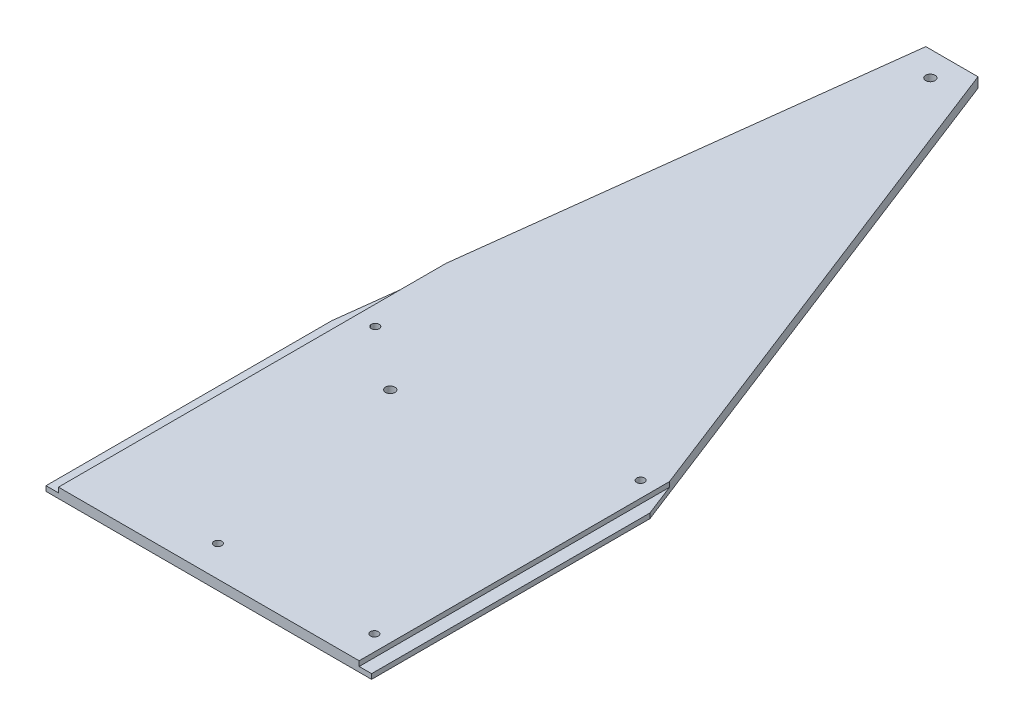
ISO-10303-21;
HEADER;
FILE_DESCRIPTION(('STEP AP214'),'2;1');
FILE_NAME('part.step','',(''),(''),'','','');
FILE_SCHEMA(('AUTOMOTIVE_DESIGN { 1 0 10303 214 1 1 1 1 }'));
ENDSEC;
DATA;
#1=APPLICATION_CONTEXT('core data for automotive mechanical design processes');
#2=APPLICATION_PROTOCOL_DEFINITION('international standard','automotive_design',2000,#1);
#3=PRODUCT_CONTEXT('',#1,'mechanical');
#4=PRODUCT('Part','Part','',(#3));
#5=PRODUCT_RELATED_PRODUCT_CATEGORY('part','',(#4));
#6=PRODUCT_DEFINITION_FORMATION('','',#4);
#7=PRODUCT_DEFINITION_CONTEXT('part definition',#1,'design');
#8=PRODUCT_DEFINITION('design','',#6,#7);
#9=PRODUCT_DEFINITION_SHAPE('','',#8);
#10=(LENGTH_UNIT() NAMED_UNIT(*) SI_UNIT(.MILLI.,.METRE.));
#11=(NAMED_UNIT(*) PLANE_ANGLE_UNIT() SI_UNIT($,.RADIAN.));
#12=(NAMED_UNIT(*) SI_UNIT($,.STERADIAN.) SOLID_ANGLE_UNIT());
#13=UNCERTAINTY_MEASURE_WITH_UNIT(LENGTH_MEASURE(1.E-05),#10,'distance_accuracy_value','');
#14=(GEOMETRIC_REPRESENTATION_CONTEXT(3) GLOBAL_UNCERTAINTY_ASSIGNED_CONTEXT((#13)) GLOBAL_UNIT_ASSIGNED_CONTEXT((#10,
#11,#12)) REPRESENTATION_CONTEXT('',''));
#15=CARTESIAN_POINT('',(0.,0.,0.));
#16=DIRECTION('',(0.,0.,1.));
#17=DIRECTION('',(1.,0.,0.));
#18=AXIS2_PLACEMENT_3D('',#15,#16,#17);
#19=CARTESIAN_POINT('',(0.,6.35,0.));
#20=DIRECTION('',(0.,-1.,0.));
#21=DIRECTION('',(0.,0.,-1.));
#22=AXIS2_PLACEMENT_3D('',#19,#20,#21);
#23=PLANE('',#22);
#24=DIRECTION('',(-0.121166373397696,0.,0.99263221283497));
#25=VECTOR('',#24,1.);
#26=CARTESIAN_POINT('',(0.,6.35,-182.5625));
#27=LINE('',#26,#25);
#28=CARTESIAN_POINT('',(41.2749999999999,6.35,-520.7));
#29=VERTEX_POINT('',#28);
#30=CARTESIAN_POINT('',(7.9375,6.35,-247.588942307692));
#31=VERTEX_POINT('',#30);
#32=EDGE_CURVE('E221',#29,#31,#27,.T.);
#33=ORIENTED_EDGE('',*,*,#32,.T.);
#34=DIRECTION('',(0.,0.,1.));
#35=VECTOR('',#34,1.);
#36=CARTESIAN_POINT('',(7.9375,6.35,-520.7));
#37=LINE('',#36,#35);
#38=CARTESIAN_POINT('',(7.9375,6.35,0.));
#39=VERTEX_POINT('',#38);
#40=EDGE_CURVE('E123',#31,#39,#37,.T.);
#41=ORIENTED_EDGE('',*,*,#40,.T.);
#42=DIRECTION('',(1.,0.,0.));
#43=VECTOR('',#42,1.);
#44=CARTESIAN_POINT('',(207.9625,6.35,0.));
#45=LINE('',#44,#43);
#46=CARTESIAN_POINT('',(200.025,6.35,0.));
#47=VERTEX_POINT('',#46);
#48=EDGE_CURVE('E210',#39,#47,#45,.T.);
#49=ORIENTED_EDGE('',*,*,#48,.T.);
#50=DIRECTION('',(0.,0.,1.));
#51=VECTOR('',#50,1.);
#52=CARTESIAN_POINT('',(200.025,6.35,-520.7));
#53=LINE('',#52,#51);
#54=CARTESIAN_POINT('',(200.025,6.35,-198.210714285714));
#55=VERTEX_POINT('',#54);
#56=EDGE_CURVE('E148',#55,#47,#53,.T.);
#57=ORIENTED_EDGE('',*,*,#56,.F.);
#58=DIRECTION('',(-0.362446261154949,0.,-0.932004671541296));
#59=VECTOR('',#58,1.);
#60=CARTESIAN_POINT('',(74.6124999999999,6.35,-520.7));
#61=LINE('',#60,#59);
#62=CARTESIAN_POINT('',(74.6124999999999,6.35,-520.7));
#63=VERTEX_POINT('',#62);
#64=EDGE_CURVE('E214',#55,#63,#61,.T.);
#65=ORIENTED_EDGE('',*,*,#64,.T.);
#66=DIRECTION('',(-1.,0.,0.));
#67=VECTOR('',#66,1.);
#68=CARTESIAN_POINT('',(41.2749999999999,6.35,-520.7));
#69=LINE('',#68,#67);
#70=EDGE_CURVE('E218',#63,#29,#69,.T.);
#71=ORIENTED_EDGE('',*,*,#70,.T.);
#72=EDGE_LOOP('',(#33,#41,#49,#57,#65,#71));
#73=FACE_BOUND('',#72,.T.);
#74=CARTESIAN_POINT('',(60.0616588419404,6.35,-504.825));
#75=DIRECTION('',(0.,1.,0.));
#76=DIRECTION('',(0.,0.,1.));
#77=AXIS2_PLACEMENT_3D('',#74,#75,#76);
#78=CIRCLE('',#77,3.00000000000001);
#79=CARTESIAN_POINT('',(60.0616588419404,6.35,-501.825));
#80=VERTEX_POINT('',#79);
#81=EDGE_CURVE('E202',#80,#80,#78,.T.);
#82=ORIENTED_EDGE('',*,*,#81,.F.);
#83=EDGE_LOOP('',(#82));
#84=FACE_BOUND('',#83,.T.);
#85=CARTESIAN_POINT('',(20.3016588419406,6.35,-190.035));
#86=DIRECTION('',(0.,1.,0.));
#87=DIRECTION('',(0.,0.,1.));
#88=AXIS2_PLACEMENT_3D('',#85,#86,#87);
#89=CIRCLE('',#88,2.5);
#90=CARTESIAN_POINT('',(20.3016588419406,6.35,-187.535));
#91=VERTEX_POINT('',#90);
#92=EDGE_CURVE('E194',#91,#91,#89,.T.);
#93=ORIENTED_EDGE('',*,*,#92,.F.);
#94=EDGE_LOOP('',(#93));
#95=FACE_BOUND('',#94,.T.);
#96=CARTESIAN_POINT('',(190.081658841941,6.35,-189.735));
#97=DIRECTION('',(0.,1.,0.));
#98=DIRECTION('',(0.,0.,1.));
#99=AXIS2_PLACEMENT_3D('',#96,#97,#98);
#100=CIRCLE('',#99,2.5);
#101=CARTESIAN_POINT('',(190.081658841941,6.35,-187.235));
#102=VERTEX_POINT('',#101);
#103=EDGE_CURVE('E186',#102,#102,#100,.T.);
#104=ORIENTED_EDGE('',*,*,#103,.F.);
#105=EDGE_LOOP('',(#104));
#106=FACE_BOUND('',#105,.T.);
#107=CARTESIAN_POINT('',(190.001658841941,6.35,-19.755));
#108=DIRECTION('',(0.,1.,0.));
#109=DIRECTION('',(0.,0.,1.));
#110=AXIS2_PLACEMENT_3D('',#107,#108,#109);
#111=CIRCLE('',#110,2.5);
#112=CARTESIAN_POINT('',(190.001658841941,6.35,-17.255));
#113=VERTEX_POINT('',#112);
#114=EDGE_CURVE('E178',#113,#113,#111,.T.);
#115=ORIENTED_EDGE('',*,*,#114,.F.);
#116=EDGE_LOOP('',(#115));
#117=FACE_BOUND('',#116,.T.);
#118=CARTESIAN_POINT('',(90.0316588419406,6.35,-19.755));
#119=DIRECTION('',(0.,1.,0.));
#120=DIRECTION('',(0.,0.,1.));
#121=AXIS2_PLACEMENT_3D('',#118,#119,#120);
#122=CIRCLE('',#121,2.5);
#123=CARTESIAN_POINT('',(90.0316588419406,6.35,-17.255));
#124=VERTEX_POINT('',#123);
#125=EDGE_CURVE('E170',#124,#124,#122,.T.);
#126=ORIENTED_EDGE('',*,*,#125,.F.);
#127=EDGE_LOOP('',(#126));
#128=FACE_BOUND('',#127,.T.);
#129=CARTESIAN_POINT('',(60.0616588419405,6.35,-159.795000000001));
#130=DIRECTION('',(0.,1.,0.));
#131=DIRECTION('',(0.,0.,1.));
#132=AXIS2_PLACEMENT_3D('',#129,#130,#131);
#133=CIRCLE('',#132,3.00000000000001);
#134=CARTESIAN_POINT('',(60.0616588419405,6.35,-156.795000000001));
#135=VERTEX_POINT('',#134);
#136=EDGE_CURVE('E162',#135,#135,#133,.T.);
#137=ORIENTED_EDGE('',*,*,#136,.F.);
#138=EDGE_LOOP('',(#137));
#139=FACE_BOUND('',#138,.T.);
#140=ADVANCED_FACE('F39',(#73,#84,#95,#106,#117,#128,#139),#23,.F.);
#141=CARTESIAN_POINT('',(0.,0.,0.));
#142=DIRECTION('',(0.,-1.,0.));
#143=DIRECTION('',(0.,0.,-1.));
#144=AXIS2_PLACEMENT_3D('',#141,#142,#143);
#145=PLANE('',#144);
#146=CARTESIAN_POINT('',(90.0316588419406,0.,-19.755));
#147=DIRECTION('',(0.,1.,0.));
#148=DIRECTION('',(0.,0.,1.));
#149=AXIS2_PLACEMENT_3D('',#146,#147,#148);
#150=CIRCLE('',#149,2.5);
#151=CARTESIAN_POINT('',(90.0316588419406,0.,-17.255));
#152=VERTEX_POINT('',#151);
#153=EDGE_CURVE('E166',#152,#152,#150,.T.);
#154=ORIENTED_EDGE('',*,*,#153,.T.);
#155=EDGE_LOOP('',(#154));
#156=FACE_BOUND('',#155,.T.);
#157=CARTESIAN_POINT('',(190.081658841941,0.,-189.735));
#158=DIRECTION('',(0.,1.,0.));
#159=DIRECTION('',(0.,0.,1.));
#160=AXIS2_PLACEMENT_3D('',#157,#158,#159);
#161=CIRCLE('',#160,2.5);
#162=CARTESIAN_POINT('',(190.081658841941,0.,-187.235));
#163=VERTEX_POINT('',#162);
#164=EDGE_CURVE('E182',#163,#163,#161,.T.);
#165=ORIENTED_EDGE('',*,*,#164,.T.);
#166=EDGE_LOOP('',(#165));
#167=FACE_BOUND('',#166,.T.);
#168=CARTESIAN_POINT('',(60.0616588419404,0.,-504.825));
#169=DIRECTION('',(0.,1.,0.));
#170=DIRECTION('',(0.,0.,1.));
#171=AXIS2_PLACEMENT_3D('',#168,#169,#170);
#172=CIRCLE('',#171,3.00000000000001);
#173=CARTESIAN_POINT('',(60.0616588419404,0.,-501.825));
#174=VERTEX_POINT('',#173);
#175=EDGE_CURVE('E198',#174,#174,#172,.T.);
#176=ORIENTED_EDGE('',*,*,#175,.T.);
#177=EDGE_LOOP('',(#176));
#178=FACE_BOUND('',#177,.T.);
#179=DIRECTION('',(1.,0.,0.));
#180=VECTOR('',#179,1.);
#181=CARTESIAN_POINT('',(207.9625,0.,0.));
#182=LINE('',#181,#180);
#183=CARTESIAN_POINT('',(0.,0.,0.));
#184=VERTEX_POINT('',#183);
#185=CARTESIAN_POINT('',(207.9625,0.,0.));
#186=VERTEX_POINT('',#185);
#187=EDGE_CURVE('E206',#184,#186,#182,.T.);
#188=ORIENTED_EDGE('',*,*,#187,.F.);
#189=DIRECTION('',(0.,0.,1.));
#190=VECTOR('',#189,1.);
#191=CARTESIAN_POINT('',(0.,0.,0.));
#192=LINE('',#191,#190);
#193=CARTESIAN_POINT('',(0.,0.,-182.5625));
#194=VERTEX_POINT('',#193);
#195=EDGE_CURVE('E215',#194,#184,#192,.T.);
#196=ORIENTED_EDGE('',*,*,#195,.F.);
#197=DIRECTION('',(-0.121166373397696,0.,0.99263221283497));
#198=VECTOR('',#197,1.);
#199=CARTESIAN_POINT('',(0.,0.,-182.5625));
#200=LINE('',#199,#198);
#201=CARTESIAN_POINT('',(41.2749999999999,0.,-520.7));
#202=VERTEX_POINT('',#201);
#203=EDGE_CURVE('E238',#202,#194,#200,.T.);
#204=ORIENTED_EDGE('',*,*,#203,.F.);
#205=DIRECTION('',(-1.,0.,0.));
#206=VECTOR('',#205,1.);
#207=CARTESIAN_POINT('',(41.2749999999999,0.,-520.7));
#208=LINE('',#207,#206);
#209=CARTESIAN_POINT('',(74.6124999999999,0.,-520.7));
#210=VERTEX_POINT('',#209);
#211=EDGE_CURVE('E235',#210,#202,#208,.T.);
#212=ORIENTED_EDGE('',*,*,#211,.F.);
#213=DIRECTION('',(-0.362446261154949,0.,-0.932004671541296));
#214=VECTOR('',#213,1.);
#215=CARTESIAN_POINT('',(74.6124999999999,0.,-520.7));
#216=LINE('',#215,#214);
#217=CARTESIAN_POINT('',(207.9625,0.,-177.8));
#218=VERTEX_POINT('',#217);
#219=EDGE_CURVE('E232',#218,#210,#216,.T.);
#220=ORIENTED_EDGE('',*,*,#219,.F.);
#221=DIRECTION('',(0.,0.,-1.));
#222=VECTOR('',#221,1.);
#223=CARTESIAN_POINT('',(207.9625,0.,-177.8));
#224=LINE('',#223,#222);
#225=EDGE_CURVE('E228',#186,#218,#224,.T.);
#226=ORIENTED_EDGE('',*,*,#225,.F.);
#227=EDGE_LOOP('',(#188,#196,#204,#212,#220,#226));
#228=FACE_BOUND('',#227,.T.);
#229=CARTESIAN_POINT('',(20.3016588419406,0.,-190.035));
#230=DIRECTION('',(0.,1.,0.));
#231=DIRECTION('',(0.,0.,1.));
#232=AXIS2_PLACEMENT_3D('',#229,#230,#231);
#233=CIRCLE('',#232,2.5);
#234=CARTESIAN_POINT('',(20.3016588419406,0.,-187.535));
#235=VERTEX_POINT('',#234);
#236=EDGE_CURVE('E190',#235,#235,#233,.T.);
#237=ORIENTED_EDGE('',*,*,#236,.T.);
#238=EDGE_LOOP('',(#237));
#239=FACE_BOUND('',#238,.T.);
#240=CARTESIAN_POINT('',(190.001658841941,0.,-19.755));
#241=DIRECTION('',(0.,1.,0.));
#242=DIRECTION('',(0.,0.,1.));
#243=AXIS2_PLACEMENT_3D('',#240,#241,#242);
#244=CIRCLE('',#243,2.5);
#245=CARTESIAN_POINT('',(190.001658841941,0.,-17.255));
#246=VERTEX_POINT('',#245);
#247=EDGE_CURVE('E174',#246,#246,#244,.T.);
#248=ORIENTED_EDGE('',*,*,#247,.T.);
#249=EDGE_LOOP('',(#248));
#250=FACE_BOUND('',#249,.T.);
#251=CARTESIAN_POINT('',(60.0616588419405,0.,-159.795000000001));
#252=DIRECTION('',(0.,1.,0.));
#253=DIRECTION('',(0.,0.,1.));
#254=AXIS2_PLACEMENT_3D('',#251,#252,#253);
#255=CIRCLE('',#254,3.00000000000001);
#256=CARTESIAN_POINT('',(60.0616588419405,0.,-156.795000000001));
#257=VERTEX_POINT('',#256);
#258=EDGE_CURVE('E161',#257,#257,#255,.T.);
#259=ORIENTED_EDGE('',*,*,#258,.T.);
#260=EDGE_LOOP('',(#259));
#261=FACE_BOUND('',#260,.T.);
#262=ADVANCED_FACE('F290',(#156,#167,#178,#228,#239,#250,#261),#145,.T.);
#263=CARTESIAN_POINT('',(207.9625,6.35,0.));
#264=DIRECTION('',(0.,0.,-1.));
#265=DIRECTION('',(-1.,0.,0.));
#266=AXIS2_PLACEMENT_3D('',#263,#264,#265);
#267=PLANE('',#266);
#268=ORIENTED_EDGE('',*,*,#48,.F.);
#269=DIRECTION('',(0.,-1.,0.));
#270=VECTOR('',#269,1.);
#271=CARTESIAN_POINT('',(7.93749999999999,6.35,0.));
#272=LINE('',#271,#270);
#273=CARTESIAN_POINT('',(7.9375,3.175,0.));
#274=VERTEX_POINT('',#273);
#275=EDGE_CURVE('E144',#39,#274,#272,.T.);
#276=ORIENTED_EDGE('',*,*,#275,.T.);
#277=DIRECTION('',(-1.,0.,0.));
#278=VECTOR('',#277,1.);
#279=CARTESIAN_POINT('',(207.9625,3.175,0.));
#280=LINE('',#279,#278);
#281=CARTESIAN_POINT('',(0.,3.175,0.));
#282=VERTEX_POINT('',#281);
#283=EDGE_CURVE('E132',#274,#282,#280,.T.);
#284=ORIENTED_EDGE('',*,*,#283,.T.);
#285=DIRECTION('',(0.,-1.,0.));
#286=VECTOR('',#285,1.);
#287=CARTESIAN_POINT('',(0.,6.35,0.));
#288=LINE('',#287,#286);
#289=EDGE_CURVE('E224',#282,#184,#288,.T.);
#290=ORIENTED_EDGE('',*,*,#289,.T.);
#291=ORIENTED_EDGE('',*,*,#187,.T.);
#292=DIRECTION('',(0.,-1.,0.));
#293=VECTOR('',#292,1.);
#294=CARTESIAN_POINT('',(207.9625,6.35,0.));
#295=LINE('',#294,#293);
#296=CARTESIAN_POINT('',(207.9625,3.175,0.));
#297=VERTEX_POINT('',#296);
#298=EDGE_CURVE('E259',#297,#186,#295,.T.);
#299=ORIENTED_EDGE('',*,*,#298,.F.);
#300=DIRECTION('',(-1.,0.,0.));
#301=VECTOR('',#300,1.);
#302=CARTESIAN_POINT('',(207.9625,3.175,0.));
#303=LINE('',#302,#301);
#304=CARTESIAN_POINT('',(200.025,3.175,0.));
#305=VERTEX_POINT('',#304);
#306=EDGE_CURVE('E157',#297,#305,#303,.T.);
#307=ORIENTED_EDGE('',*,*,#306,.T.);
#308=DIRECTION('',(0.,1.,0.));
#309=VECTOR('',#308,1.);
#310=CARTESIAN_POINT('',(200.025,6.35,0.));
#311=LINE('',#310,#309);
#312=EDGE_CURVE('E153',#305,#47,#311,.T.);
#313=ORIENTED_EDGE('',*,*,#312,.T.);
#314=EDGE_LOOP('',(#268,#276,#284,#290,#291,#299,#307,#313));
#315=FACE_BOUND('',#314,.T.);
#316=ADVANCED_FACE('F41',(#315),#267,.F.);
#317=CARTESIAN_POINT('',(207.9625,6.35,-177.8));
#318=DIRECTION('',(-1.,0.,0.));
#319=DIRECTION('',(0.,0.,1.));
#320=AXIS2_PLACEMENT_3D('',#317,#318,#319);
#321=PLANE('',#320);
#322=DIRECTION('',(0.,-1.,0.));
#323=VECTOR('',#322,1.);
#324=CARTESIAN_POINT('',(207.9625,6.35,-177.8));
#325=LINE('',#324,#323);
#326=CARTESIAN_POINT('',(207.9625,3.175,-177.8));
#327=VERTEX_POINT('',#326);
#328=EDGE_CURVE('E256',#327,#218,#325,.T.);
#329=ORIENTED_EDGE('',*,*,#328,.F.);
#330=DIRECTION('',(0.,0.,1.));
#331=VECTOR('',#330,1.);
#332=CARTESIAN_POINT('',(207.9625,3.175,-520.7));
#333=LINE('',#332,#331);
#334=EDGE_CURVE('E134',#327,#297,#333,.T.);
#335=ORIENTED_EDGE('',*,*,#334,.T.);
#336=ORIENTED_EDGE('',*,*,#298,.T.);
#337=ORIENTED_EDGE('',*,*,#225,.T.);
#338=EDGE_LOOP('',(#329,#335,#336,#337));
#339=FACE_BOUND('',#338,.T.);
#340=ADVANCED_FACE('F283',(#339),#321,.F.);
#341=CARTESIAN_POINT('',(74.6124999999999,6.35,-520.7));
#342=DIRECTION('',(-0.932004671541296,0.,0.362446261154949));
#343=DIRECTION('',(0.362446261154949,0.,0.932004671541296));
#344=AXIS2_PLACEMENT_3D('',#341,#342,#343);
#345=PLANE('',#344);
#346=DIRECTION('',(0.,-1.,0.));
#347=VECTOR('',#346,1.);
#348=CARTESIAN_POINT('',(200.025,6.35,-198.210714285714));
#349=LINE('',#348,#347);
#350=CARTESIAN_POINT('',(200.025,3.175,-198.210714285714));
#351=VERTEX_POINT('',#350);
#352=EDGE_CURVE('E48',#55,#351,#349,.T.);
#353=ORIENTED_EDGE('',*,*,#352,.T.);
#354=DIRECTION('',(0.362446261154949,0.,0.932004671541296));
#355=VECTOR('',#354,1.);
#356=CARTESIAN_POINT('',(74.6124999999999,3.175,-520.7));
#357=LINE('',#356,#355);
#358=EDGE_CURVE('E11',#351,#327,#357,.T.);
#359=ORIENTED_EDGE('',*,*,#358,.T.);
#360=ORIENTED_EDGE('',*,*,#328,.T.);
#361=ORIENTED_EDGE('',*,*,#219,.T.);
#362=DIRECTION('',(0.,-1.,0.));
#363=VECTOR('',#362,1.);
#364=CARTESIAN_POINT('',(74.6124999999999,6.35,-520.7));
#365=LINE('',#364,#363);
#366=EDGE_CURVE('E252',#63,#210,#365,.T.);
#367=ORIENTED_EDGE('',*,*,#366,.F.);
#368=ORIENTED_EDGE('',*,*,#64,.F.);
#369=EDGE_LOOP('',(#353,#359,#360,#361,#367,#368));
#370=FACE_BOUND('',#369,.T.);
#371=ADVANCED_FACE('F267',(#370),#345,.F.);
#372=CARTESIAN_POINT('',(41.2749999999999,6.35,-520.7));
#373=DIRECTION('',(0.,0.,1.));
#374=DIRECTION('',(1.,0.,0.));
#375=AXIS2_PLACEMENT_3D('',#372,#373,#374);
#376=PLANE('',#375);
#377=ORIENTED_EDGE('',*,*,#211,.T.);
#378=DIRECTION('',(0.,-1.,0.));
#379=VECTOR('',#378,1.);
#380=CARTESIAN_POINT('',(41.2749999999999,6.35,-520.7));
#381=LINE('',#380,#379);
#382=EDGE_CURVE('E248',#29,#202,#381,.T.);
#383=ORIENTED_EDGE('',*,*,#382,.F.);
#384=ORIENTED_EDGE('',*,*,#70,.F.);
#385=ORIENTED_EDGE('',*,*,#366,.T.);
#386=EDGE_LOOP('',(#377,#383,#384,#385));
#387=FACE_BOUND('',#386,.T.);
#388=ADVANCED_FACE('F297',(#387),#376,.F.);
#389=CARTESIAN_POINT('',(0.,6.35,-182.5625));
#390=DIRECTION('',(0.99263221283497,0.,0.121166373397696));
#391=DIRECTION('',(0.121166373397696,0.,-0.99263221283497));
#392=AXIS2_PLACEMENT_3D('',#389,#390,#391);
#393=PLANE('',#392);
#394=DIRECTION('',(0.121166373397696,0.,-0.99263221283497));
#395=VECTOR('',#394,1.);
#396=CARTESIAN_POINT('',(0.,3.175,-182.5625));
#397=LINE('',#396,#395);
#398=CARTESIAN_POINT('',(0.,3.175,-182.5625));
#399=VERTEX_POINT('',#398);
#400=CARTESIAN_POINT('',(7.93750000000003,3.175,-247.588942307693));
#401=VERTEX_POINT('',#400);
#402=EDGE_CURVE('E63',#399,#401,#397,.T.);
#403=ORIENTED_EDGE('',*,*,#402,.T.);
#404=DIRECTION('',(0.,1.,0.));
#405=VECTOR('',#404,1.);
#406=CARTESIAN_POINT('',(7.9375,6.35,-247.588942307692));
#407=LINE('',#406,#405);
#408=EDGE_CURVE('E118',#401,#31,#407,.T.);
#409=ORIENTED_EDGE('',*,*,#408,.T.);
#410=ORIENTED_EDGE('',*,*,#32,.F.);
#411=ORIENTED_EDGE('',*,*,#382,.T.);
#412=ORIENTED_EDGE('',*,*,#203,.T.);
#413=DIRECTION('',(0.,-1.,0.));
#414=VECTOR('',#413,1.);
#415=CARTESIAN_POINT('',(0.,6.35,-182.5625));
#416=LINE('',#415,#414);
#417=EDGE_CURVE('E139',#399,#194,#416,.T.);
#418=ORIENTED_EDGE('',*,*,#417,.F.);
#419=EDGE_LOOP('',(#403,#409,#410,#411,#412,#418));
#420=FACE_BOUND('',#419,.T.);
#421=ADVANCED_FACE('F137',(#420),#393,.F.);
#422=CARTESIAN_POINT('',(0.,6.35,0.));
#423=DIRECTION('',(1.,0.,0.));
#424=DIRECTION('',(0.,0.,-1.));
#425=AXIS2_PLACEMENT_3D('',#422,#423,#424);
#426=PLANE('',#425);
#427=ORIENTED_EDGE('',*,*,#289,.F.);
#428=DIRECTION('',(0.,0.,-1.));
#429=VECTOR('',#428,1.);
#430=CARTESIAN_POINT('',(0.,3.175,0.));
#431=LINE('',#430,#429);
#432=EDGE_CURVE('E128',#282,#399,#431,.T.);
#433=ORIENTED_EDGE('',*,*,#432,.T.);
#434=ORIENTED_EDGE('',*,*,#417,.T.);
#435=ORIENTED_EDGE('',*,*,#195,.T.);
#436=EDGE_LOOP('',(#427,#433,#434,#435));
#437=FACE_BOUND('',#436,.T.);
#438=ADVANCED_FACE('F300',(#437),#426,.F.);
#439=CARTESIAN_POINT('',(60.0616588419404,6.35,-504.825));
#440=DIRECTION('',(0.,-1.,0.));
#441=DIRECTION('',(0.,0.,-1.));
#442=AXIS2_PLACEMENT_3D('',#439,#440,#441);
#443=CYLINDRICAL_SURFACE('',#442,3.00000000000001);
#444=ORIENTED_EDGE('',*,*,#81,.T.);
#445=EDGE_LOOP('',(#444));
#446=FACE_BOUND('',#445,.T.);
#447=ORIENTED_EDGE('',*,*,#175,.F.);
#448=EDGE_LOOP('',(#447));
#449=FACE_BOUND('',#448,.T.);
#450=ADVANCED_FACE('F302',(#446,#449),#443,.F.);
#451=CARTESIAN_POINT('',(20.3016588419406,6.35,-190.035));
#452=DIRECTION('',(0.,-1.,0.));
#453=DIRECTION('',(0.,0.,-1.));
#454=AXIS2_PLACEMENT_3D('',#451,#452,#453);
#455=CYLINDRICAL_SURFACE('',#454,2.5);
#456=ORIENTED_EDGE('',*,*,#92,.T.);
#457=EDGE_LOOP('',(#456));
#458=FACE_BOUND('',#457,.T.);
#459=ORIENTED_EDGE('',*,*,#236,.F.);
#460=EDGE_LOOP('',(#459));
#461=FACE_BOUND('',#460,.T.);
#462=ADVANCED_FACE('F308',(#458,#461),#455,.F.);
#463=CARTESIAN_POINT('',(190.081658841941,6.35,-189.735));
#464=DIRECTION('',(0.,-1.,0.));
#465=DIRECTION('',(0.,0.,-1.));
#466=AXIS2_PLACEMENT_3D('',#463,#464,#465);
#467=CYLINDRICAL_SURFACE('',#466,2.5);
#468=ORIENTED_EDGE('',*,*,#103,.T.);
#469=EDGE_LOOP('',(#468));
#470=FACE_BOUND('',#469,.T.);
#471=ORIENTED_EDGE('',*,*,#164,.F.);
#472=EDGE_LOOP('',(#471));
#473=FACE_BOUND('',#472,.T.);
#474=ADVANCED_FACE('F322',(#470,#473),#467,.F.);
#475=CARTESIAN_POINT('',(190.001658841941,6.35,-19.755));
#476=DIRECTION('',(0.,-1.,0.));
#477=DIRECTION('',(0.,0.,-1.));
#478=AXIS2_PLACEMENT_3D('',#475,#476,#477);
#479=CYLINDRICAL_SURFACE('',#478,2.5);
#480=ORIENTED_EDGE('',*,*,#114,.T.);
#481=EDGE_LOOP('',(#480));
#482=FACE_BOUND('',#481,.T.);
#483=ORIENTED_EDGE('',*,*,#247,.F.);
#484=EDGE_LOOP('',(#483));
#485=FACE_BOUND('',#484,.T.);
#486=ADVANCED_FACE('F326',(#482,#485),#479,.F.);
#487=CARTESIAN_POINT('',(90.0316588419406,6.35,-19.755));
#488=DIRECTION('',(0.,-1.,0.));
#489=DIRECTION('',(0.,0.,-1.));
#490=AXIS2_PLACEMENT_3D('',#487,#488,#489);
#491=CYLINDRICAL_SURFACE('',#490,2.5);
#492=ORIENTED_EDGE('',*,*,#125,.T.);
#493=EDGE_LOOP('',(#492));
#494=FACE_BOUND('',#493,.T.);
#495=ORIENTED_EDGE('',*,*,#153,.F.);
#496=EDGE_LOOP('',(#495));
#497=FACE_BOUND('',#496,.T.);
#498=ADVANCED_FACE('F330',(#494,#497),#491,.F.);
#499=CARTESIAN_POINT('',(60.0616588419405,6.35,-159.795000000001));
#500=DIRECTION('',(0.,-1.,0.));
#501=DIRECTION('',(0.,0.,-1.));
#502=AXIS2_PLACEMENT_3D('',#499,#500,#501);
#503=CYLINDRICAL_SURFACE('',#502,3.00000000000001);
#504=ORIENTED_EDGE('',*,*,#136,.T.);
#505=EDGE_LOOP('',(#504));
#506=FACE_BOUND('',#505,.T.);
#507=ORIENTED_EDGE('',*,*,#258,.F.);
#508=EDGE_LOOP('',(#507));
#509=FACE_BOUND('',#508,.T.);
#510=ADVANCED_FACE('F334',(#506,#509),#503,.F.);
#511=CARTESIAN_POINT('',(7.9375,3.175,-520.7));
#512=DIRECTION('',(1.,0.,0.));
#513=DIRECTION('',(0.,0.,-1.));
#514=AXIS2_PLACEMENT_3D('',#511,#512,#513);
#515=PLANE('',#514);
#516=ORIENTED_EDGE('',*,*,#40,.F.);
#517=ORIENTED_EDGE('',*,*,#408,.F.);
#518=DIRECTION('',(0.,0.,1.));
#519=VECTOR('',#518,1.);
#520=CARTESIAN_POINT('',(7.9375,3.175,-520.7));
#521=LINE('',#520,#519);
#522=EDGE_CURVE('E120',#401,#274,#521,.T.);
#523=ORIENTED_EDGE('',*,*,#522,.T.);
#524=ORIENTED_EDGE('',*,*,#275,.F.);
#525=EDGE_LOOP('',(#516,#517,#523,#524));
#526=FACE_BOUND('',#525,.T.);
#527=ADVANCED_FACE('F119',(#526),#515,.F.);
#528=CARTESIAN_POINT('',(0.,3.175,-520.7));
#529=DIRECTION('',(0.,-1.,0.));
#530=DIRECTION('',(0.,0.,-1.));
#531=AXIS2_PLACEMENT_3D('',#528,#529,#530);
#532=PLANE('',#531);
#533=ORIENTED_EDGE('',*,*,#522,.F.);
#534=ORIENTED_EDGE('',*,*,#402,.F.);
#535=ORIENTED_EDGE('',*,*,#432,.F.);
#536=ORIENTED_EDGE('',*,*,#283,.F.);
#537=EDGE_LOOP('',(#533,#534,#535,#536));
#538=FACE_BOUND('',#537,.T.);
#539=ADVANCED_FACE('F130',(#538),#532,.F.);
#540=CARTESIAN_POINT('',(200.025,3.175,-520.7));
#541=DIRECTION('',(0.,-1.,0.));
#542=DIRECTION('',(0.,0.,-1.));
#543=AXIS2_PLACEMENT_3D('',#540,#541,#542);
#544=PLANE('',#543);
#545=ORIENTED_EDGE('',*,*,#334,.F.);
#546=ORIENTED_EDGE('',*,*,#358,.F.);
#547=DIRECTION('',(0.,0.,1.));
#548=VECTOR('',#547,1.);
#549=CARTESIAN_POINT('',(200.025,3.175,-520.7));
#550=LINE('',#549,#548);
#551=EDGE_CURVE('E55',#351,#305,#550,.T.);
#552=ORIENTED_EDGE('',*,*,#551,.T.);
#553=ORIENTED_EDGE('',*,*,#306,.F.);
#554=EDGE_LOOP('',(#545,#546,#552,#553));
#555=FACE_BOUND('',#554,.T.);
#556=ADVANCED_FACE('F341',(#555),#544,.F.);
#557=CARTESIAN_POINT('',(200.025,6.35,-520.7));
#558=DIRECTION('',(-1.,0.,0.));
#559=DIRECTION('',(0.,0.,1.));
#560=AXIS2_PLACEMENT_3D('',#557,#558,#559);
#561=PLANE('',#560);
#562=ORIENTED_EDGE('',*,*,#551,.F.);
#563=ORIENTED_EDGE('',*,*,#352,.F.);
#564=ORIENTED_EDGE('',*,*,#56,.T.);
#565=ORIENTED_EDGE('',*,*,#312,.F.);
#566=EDGE_LOOP('',(#562,#563,#564,#565));
#567=FACE_BOUND('',#566,.T.);
#568=ADVANCED_FACE('F271',(#567),#561,.F.);
#569=CLOSED_SHELL('',(#140,#262,#316,#340,#371,#388,#421,#438,#450,#462,#474,#486,#498,#510,
#527,#539,#556,#568));
#570=MANIFOLD_SOLID_BREP('B2',#569);
#571=ADVANCED_BREP_SHAPE_REPRESENTATION('',(#18,#570),#14);
#572=SHAPE_DEFINITION_REPRESENTATION(#9,#571);
ENDSEC;
END-ISO-10303-21;
